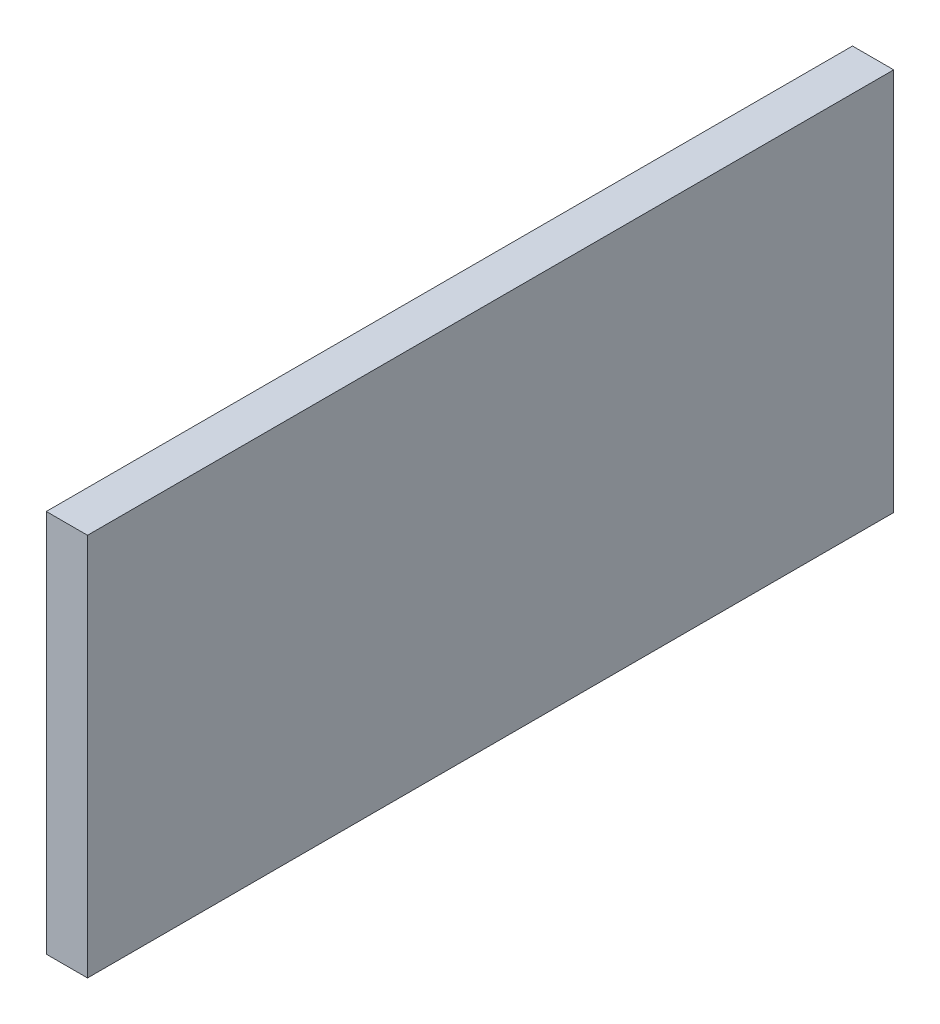
ISO-10303-21;
HEADER;
FILE_DESCRIPTION(('STEP AP214'),'2;1');
FILE_NAME('part.step','',(''),(''),'','','');
FILE_SCHEMA(('AUTOMOTIVE_DESIGN { 1 0 10303 214 1 1 1 1 }'));
ENDSEC;
DATA;
#1=APPLICATION_CONTEXT('core data for automotive mechanical design processes');
#2=APPLICATION_PROTOCOL_DEFINITION('international standard','automotive_design',2000,#1);
#3=PRODUCT_CONTEXT('',#1,'mechanical');
#4=PRODUCT('Part','Part','',(#3));
#5=PRODUCT_RELATED_PRODUCT_CATEGORY('part','',(#4));
#6=PRODUCT_DEFINITION_FORMATION('','',#4);
#7=PRODUCT_DEFINITION_CONTEXT('part definition',#1,'design');
#8=PRODUCT_DEFINITION('design','',#6,#7);
#9=PRODUCT_DEFINITION_SHAPE('','',#8);
#10=(LENGTH_UNIT() NAMED_UNIT(*) SI_UNIT(.MILLI.,.METRE.));
#11=(NAMED_UNIT(*) PLANE_ANGLE_UNIT() SI_UNIT($,.RADIAN.));
#12=(NAMED_UNIT(*) SI_UNIT($,.STERADIAN.) SOLID_ANGLE_UNIT());
#13=UNCERTAINTY_MEASURE_WITH_UNIT(LENGTH_MEASURE(1.E-05),#10,'distance_accuracy_value','');
#14=(GEOMETRIC_REPRESENTATION_CONTEXT(3) GLOBAL_UNCERTAINTY_ASSIGNED_CONTEXT((#13)) GLOBAL_UNIT_ASSIGNED_CONTEXT((#10,
#11,#12)) REPRESENTATION_CONTEXT('',''));
#15=CARTESIAN_POINT('',(0.,0.,0.));
#16=DIRECTION('',(0.,0.,1.));
#17=DIRECTION('',(1.,0.,0.));
#18=AXIS2_PLACEMENT_3D('',#15,#16,#17);
#19=CARTESIAN_POINT('',(1.5875,14.76,62.07));
#20=DIRECTION('',(-1.,0.,0.));
#21=DIRECTION('',(0.,-1.,0.));
#22=AXIS2_PLACEMENT_3D('',#19,#20,#21);
#23=PLANE('',#22);
#24=DIRECTION('',(0.,1.,0.));
#25=VECTOR('',#24,1.);
#26=CARTESIAN_POINT('',(1.5875,14.76,0.));
#27=LINE('',#26,#25);
#28=CARTESIAN_POINT('',(1.5875,-14.76,0.));
#29=VERTEX_POINT('',#28);
#30=CARTESIAN_POINT('',(1.5875,14.76,0.));
#31=VERTEX_POINT('',#30);
#32=EDGE_CURVE('E107',#29,#31,#27,.T.);
#33=ORIENTED_EDGE('',*,*,#32,.T.);
#34=DIRECTION('',(0.,0.,-1.));
#35=VECTOR('',#34,1.);
#36=CARTESIAN_POINT('',(1.5875,14.76,62.07));
#37=LINE('',#36,#35);
#38=CARTESIAN_POINT('',(1.5875,14.76,62.07));
#39=VERTEX_POINT('',#38);
#40=EDGE_CURVE('E11',#39,#31,#37,.T.);
#41=ORIENTED_EDGE('',*,*,#40,.F.);
#42=DIRECTION('',(0.,1.,0.));
#43=VECTOR('',#42,1.);
#44=CARTESIAN_POINT('',(1.5875,14.76,62.07));
#45=LINE('',#44,#43);
#46=CARTESIAN_POINT('',(1.5875,-14.76,62.07));
#47=VERTEX_POINT('',#46);
#48=EDGE_CURVE('E91',#47,#39,#45,.T.);
#49=ORIENTED_EDGE('',*,*,#48,.F.);
#50=DIRECTION('',(0.,0.,-1.));
#51=VECTOR('',#50,1.);
#52=CARTESIAN_POINT('',(1.5875,-14.76,62.07));
#53=LINE('',#52,#51);
#54=EDGE_CURVE('E103',#47,#29,#53,.T.);
#55=ORIENTED_EDGE('',*,*,#54,.T.);
#56=EDGE_LOOP('',(#33,#41,#49,#55));
#57=FACE_BOUND('',#56,.T.);
#58=ADVANCED_FACE('F39',(#57),#23,.F.);
#59=CARTESIAN_POINT('',(-1.5875,14.76,62.07));
#60=DIRECTION('',(0.,-1.,0.));
#61=DIRECTION('',(0.,0.,-1.));
#62=AXIS2_PLACEMENT_3D('',#59,#60,#61);
#63=PLANE('',#62);
#64=DIRECTION('',(-1.,0.,0.));
#65=VECTOR('',#64,1.);
#66=CARTESIAN_POINT('',(-1.5875,14.76,0.));
#67=LINE('',#66,#65);
#68=CARTESIAN_POINT('',(-1.5875,14.76,0.));
#69=VERTEX_POINT('',#68);
#70=EDGE_CURVE('E96',#31,#69,#67,.T.);
#71=ORIENTED_EDGE('',*,*,#70,.T.);
#72=DIRECTION('',(0.,0.,-1.));
#73=VECTOR('',#72,1.);
#74=CARTESIAN_POINT('',(-1.5875,14.76,62.07));
#75=LINE('',#74,#73);
#76=CARTESIAN_POINT('',(-1.5875,14.76,62.07));
#77=VERTEX_POINT('',#76);
#78=EDGE_CURVE('E48',#77,#69,#75,.T.);
#79=ORIENTED_EDGE('',*,*,#78,.F.);
#80=DIRECTION('',(-1.,0.,0.));
#81=VECTOR('',#80,1.);
#82=CARTESIAN_POINT('',(-1.5875,14.76,62.07));
#83=LINE('',#82,#81);
#84=EDGE_CURVE('E86',#39,#77,#83,.T.);
#85=ORIENTED_EDGE('',*,*,#84,.F.);
#86=ORIENTED_EDGE('',*,*,#40,.T.);
#87=EDGE_LOOP('',(#71,#79,#85,#86));
#88=FACE_BOUND('',#87,.T.);
#89=ADVANCED_FACE('F95',(#88),#63,.F.);
#90=CARTESIAN_POINT('',(-1.5875,14.76,62.07));
#91=DIRECTION('',(1.,0.,0.));
#92=DIRECTION('',(0.,1.,0.));
#93=AXIS2_PLACEMENT_3D('',#90,#91,#92);
#94=PLANE('',#93);
#95=DIRECTION('',(0.,-1.,0.));
#96=VECTOR('',#95,1.);
#97=CARTESIAN_POINT('',(-1.5875,14.76,0.));
#98=LINE('',#97,#96);
#99=CARTESIAN_POINT('',(-1.5875,-14.76,0.));
#100=VERTEX_POINT('',#99);
#101=EDGE_CURVE('E73',#69,#100,#98,.T.);
#102=ORIENTED_EDGE('',*,*,#101,.T.);
#103=DIRECTION('',(0.,0.,-1.));
#104=VECTOR('',#103,1.);
#105=CARTESIAN_POINT('',(-1.5875,-14.76,62.07));
#106=LINE('',#105,#104);
#107=CARTESIAN_POINT('',(-1.5875,-14.76,62.07));
#108=VERTEX_POINT('',#107);
#109=EDGE_CURVE('E98',#108,#100,#106,.T.);
#110=ORIENTED_EDGE('',*,*,#109,.F.);
#111=DIRECTION('',(0.,-1.,0.));
#112=VECTOR('',#111,1.);
#113=CARTESIAN_POINT('',(-1.5875,14.76,62.07));
#114=LINE('',#113,#112);
#115=EDGE_CURVE('E89',#77,#108,#114,.T.);
#116=ORIENTED_EDGE('',*,*,#115,.F.);
#117=ORIENTED_EDGE('',*,*,#78,.T.);
#118=EDGE_LOOP('',(#102,#110,#116,#117));
#119=FACE_BOUND('',#118,.T.);
#120=ADVANCED_FACE('F99',(#119),#94,.F.);
#121=CARTESIAN_POINT('',(-1.5875,-14.76,62.07));
#122=DIRECTION('',(0.,1.,0.));
#123=DIRECTION('',(0.,0.,1.));
#124=AXIS2_PLACEMENT_3D('',#121,#122,#123);
#125=PLANE('',#124);
#126=DIRECTION('',(1.,0.,0.));
#127=VECTOR('',#126,1.);
#128=CARTESIAN_POINT('',(-1.5875,-14.76,0.));
#129=LINE('',#128,#127);
#130=EDGE_CURVE('E79',#100,#29,#129,.T.);
#131=ORIENTED_EDGE('',*,*,#130,.T.);
#132=ORIENTED_EDGE('',*,*,#54,.F.);
#133=DIRECTION('',(1.,0.,0.));
#134=VECTOR('',#133,1.);
#135=CARTESIAN_POINT('',(-1.5875,-14.76,62.07));
#136=LINE('',#135,#134);
#137=EDGE_CURVE('E56',#108,#47,#136,.T.);
#138=ORIENTED_EDGE('',*,*,#137,.F.);
#139=ORIENTED_EDGE('',*,*,#109,.T.);
#140=EDGE_LOOP('',(#131,#132,#138,#139));
#141=FACE_BOUND('',#140,.T.);
#142=ADVANCED_FACE('F120',(#141),#125,.F.);
#143=CARTESIAN_POINT('',(0.,0.,62.07));
#144=DIRECTION('',(0.,0.,1.));
#145=DIRECTION('',(1.,0.,0.));
#146=AXIS2_PLACEMENT_3D('',#143,#144,#145);
#147=PLANE('',#146);
#148=ORIENTED_EDGE('',*,*,#48,.T.);
#149=ORIENTED_EDGE('',*,*,#84,.T.);
#150=ORIENTED_EDGE('',*,*,#115,.T.);
#151=ORIENTED_EDGE('',*,*,#137,.T.);
#152=EDGE_LOOP('',(#148,#149,#150,#151));
#153=FACE_BOUND('',#152,.T.);
#154=ADVANCED_FACE('F87',(#153),#147,.T.);
#155=CARTESIAN_POINT('',(0.,0.,0.));
#156=DIRECTION('',(0.,0.,1.));
#157=DIRECTION('',(1.,0.,0.));
#158=AXIS2_PLACEMENT_3D('',#155,#156,#157);
#159=PLANE('',#158);
#160=ORIENTED_EDGE('',*,*,#32,.F.);
#161=ORIENTED_EDGE('',*,*,#130,.F.);
#162=ORIENTED_EDGE('',*,*,#101,.F.);
#163=ORIENTED_EDGE('',*,*,#70,.F.);
#164=EDGE_LOOP('',(#160,#161,#162,#163));
#165=FACE_BOUND('',#164,.T.);
#166=ADVANCED_FACE('F123',(#165),#159,.F.);
#167=CLOSED_SHELL('',(#58,#89,#120,#142,#154,#166));
#168=MANIFOLD_SOLID_BREP('B2',#167);
#169=ADVANCED_BREP_SHAPE_REPRESENTATION('',(#18,#168),#14);
#170=SHAPE_DEFINITION_REPRESENTATION(#9,#169);
ENDSEC;
END-ISO-10303-21;
